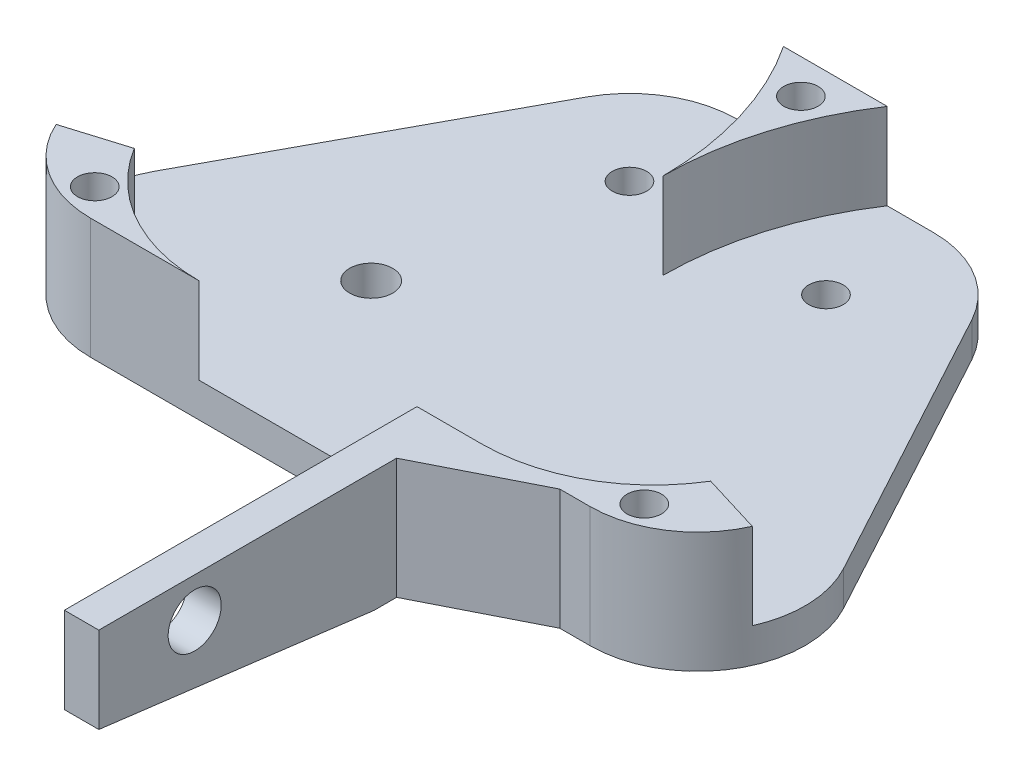
ISO-10303-21;
HEADER;
FILE_DESCRIPTION(('STEP AP214'),'2;1');
FILE_NAME('part.step','',(''),(''),'','','');
FILE_SCHEMA(('AUTOMOTIVE_DESIGN { 1 0 10303 214 1 1 1 1 }'));
ENDSEC;
DATA;
#1=APPLICATION_CONTEXT('core data for automotive mechanical design processes');
#2=APPLICATION_PROTOCOL_DEFINITION('international standard','automotive_design',2000,#1);
#3=PRODUCT_CONTEXT('',#1,'mechanical');
#4=PRODUCT('Part','Part','',(#3));
#5=PRODUCT_RELATED_PRODUCT_CATEGORY('part','',(#4));
#6=PRODUCT_DEFINITION_FORMATION('','',#4);
#7=PRODUCT_DEFINITION_CONTEXT('part definition',#1,'design');
#8=PRODUCT_DEFINITION('design','',#6,#7);
#9=PRODUCT_DEFINITION_SHAPE('','',#8);
#10=(LENGTH_UNIT() NAMED_UNIT(*) SI_UNIT(.MILLI.,.METRE.));
#11=(NAMED_UNIT(*) PLANE_ANGLE_UNIT() SI_UNIT($,.RADIAN.));
#12=(NAMED_UNIT(*) SI_UNIT($,.STERADIAN.) SOLID_ANGLE_UNIT());
#13=UNCERTAINTY_MEASURE_WITH_UNIT(LENGTH_MEASURE(1.E-05),#10,'distance_accuracy_value','');
#14=(GEOMETRIC_REPRESENTATION_CONTEXT(3) GLOBAL_UNCERTAINTY_ASSIGNED_CONTEXT((#13)) GLOBAL_UNIT_ASSIGNED_CONTEXT((#10,
#11,#12)) REPRESENTATION_CONTEXT('',''));
#15=CARTESIAN_POINT('',(0.,0.,0.));
#16=DIRECTION('',(0.,0.,1.));
#17=DIRECTION('',(1.,0.,0.));
#18=AXIS2_PLACEMENT_3D('',#15,#16,#17);
#19=CARTESIAN_POINT('',(0.,4.,20.));
#20=DIRECTION('',(0.,0.,-1.));
#21=DIRECTION('',(-1.,0.,0.));
#22=AXIS2_PLACEMENT_3D('',#19,#20,#21);
#23=PLANE('',#22);
#24=DIRECTION('',(-1.,0.,0.));
#25=VECTOR('',#24,1.);
#26=CARTESIAN_POINT('',(0.,14.,20.));
#27=LINE('',#26,#25);
#28=CARTESIAN_POINT('',(28.9958510837239,14.,20.));
#29=VERTEX_POINT('',#28);
#30=CARTESIAN_POINT('',(25.5011401283353,14.,20.));
#31=VERTEX_POINT('',#30);
#32=EDGE_CURVE('E110',#29,#31,#27,.T.);
#33=ORIENTED_EDGE('',*,*,#32,.T.);
#34=DIRECTION('',(0.,1.,0.));
#35=VECTOR('',#34,1.);
#36=CARTESIAN_POINT('',(25.5011401283353,-14.1051213627807,20.));
#37=LINE('',#36,#35);
#38=CARTESIAN_POINT('',(25.5011401283353,0.,20.));
#39=VERTEX_POINT('',#38);
#40=EDGE_CURVE('E105',#39,#31,#37,.T.);
#41=ORIENTED_EDGE('',*,*,#40,.F.);
#42=DIRECTION('',(1.,0.,0.));
#43=VECTOR('',#42,1.);
#44=CARTESIAN_POINT('',(0.,0.,20.));
#45=LINE('',#44,#43);
#46=CARTESIAN_POINT('',(28.9958510837239,0.,20.));
#47=VERTEX_POINT('',#46);
#48=EDGE_CURVE('E478',#39,#47,#45,.T.);
#49=ORIENTED_EDGE('',*,*,#48,.T.);
#50=DIRECTION('',(0.,-1.,0.));
#51=VECTOR('',#50,1.);
#52=CARTESIAN_POINT('',(28.9958510837239,4.,20.));
#53=LINE('',#52,#51);
#54=EDGE_CURVE('E98',#29,#47,#53,.T.);
#55=ORIENTED_EDGE('',*,*,#54,.F.);
#56=EDGE_LOOP('',(#33,#41,#49,#55));
#57=FACE_BOUND('',#56,.T.);
#58=ADVANCED_FACE('F89',(#57),#23,.F.);
#59=CARTESIAN_POINT('',(0.,4.,0.));
#60=DIRECTION('',(0.,1.,0.));
#61=DIRECTION('',(0.,0.,1.));
#62=AXIS2_PLACEMENT_3D('',#59,#60,#61);
#63=PLANE('',#62);
#64=CARTESIAN_POINT('',(-36.2069811131505,4.,-17.5));
#65=DIRECTION('',(0.,1.,0.));
#66=DIRECTION('',(0.,0.,1.));
#67=AXIS2_PLACEMENT_3D('',#64,#65,#66);
#68=CIRCLE('',#67,36.2069811131505);
#69=CARTESIAN_POINT('',(0.,4.,-17.5));
#70=VERTEX_POINT('',#69);
#71=CARTESIAN_POINT('',(-6.02510772318286,4.,-37.5));
#72=VERTEX_POINT('',#71);
#73=EDGE_CURVE('E329',#70,#72,#68,.T.);
#74=ORIENTED_EDGE('',*,*,#73,.T.);
#75=DIRECTION('',(1.,0.,0.));
#76=VECTOR('',#75,1.);
#77=CARTESIAN_POINT('',(0.,4.,-37.5));
#78=LINE('',#77,#76);
#79=CARTESIAN_POINT('',(-11.41,4.,-37.5));
#80=VERTEX_POINT('',#79);
#81=EDGE_CURVE('E452',#80,#72,#78,.T.);
#82=ORIENTED_EDGE('',*,*,#81,.F.);
#83=CARTESIAN_POINT('',(-11.41,4.,-25.));
#84=DIRECTION('',(0.,1.,0.));
#85=DIRECTION('',(0.,0.,1.));
#86=AXIS2_PLACEMENT_3D('',#83,#84,#85);
#87=CIRCLE('',#86,12.5);
#88=CARTESIAN_POINT('',(-22.4037432028954,4.,-30.9487486405791));
#89=VERTEX_POINT('',#88);
#90=EDGE_CURVE('E456',#80,#89,#87,.T.);
#91=ORIENTED_EDGE('',*,*,#90,.T.);
#92=DIRECTION('',(-0.475899891246327,0.,0.879499456231631));
#93=VECTOR('',#92,1.);
#94=CARTESIAN_POINT('',(-30.2834407311602,4.,-16.3864639692604));
#95=LINE('',#94,#93);
#96=CARTESIAN_POINT('',(-39.9895942866193,4.,1.55125135942092));
#97=VERTEX_POINT('',#96);
#98=EDGE_CURVE('E459',#89,#97,#95,.T.);
#99=ORIENTED_EDGE('',*,*,#98,.T.);
#100=CARTESIAN_POINT('',(-28.9958510837239,4.,7.5));
#101=DIRECTION('',(0.,1.,0.));
#102=DIRECTION('',(0.,0.,1.));
#103=AXIS2_PLACEMENT_3D('',#100,#101,#102);
#104=CIRCLE('',#103,12.5);
#105=CARTESIAN_POINT('',(-40.42167743443,4.,12.5695652874294));
#106=VERTEX_POINT('',#105);
#107=EDGE_CURVE('E430',#97,#106,#104,.T.);
#108=ORIENTED_EDGE('',*,*,#107,.T.);
#109=DIRECTION('',(0.956304755963037,0.,-0.292371704722731));
#110=VECTOR('',#109,1.);
#111=CARTESIAN_POINT('',(0.0591118064278248,4.,0.193346006837782));
#112=LINE('',#111,#110);
#113=CARTESIAN_POINT('',(-33.4669034451053,4.,10.4432774962822));
#114=VERTEX_POINT('',#113);
#115=EDGE_CURVE('E402',#106,#114,#112,.T.);
#116=ORIENTED_EDGE('',*,*,#115,.T.);
#117=CARTESIAN_POINT('',(-16.41,4.,0.));
#118=DIRECTION('',(0.,1.,0.));
#119=DIRECTION('',(0.,0.,1.));
#120=AXIS2_PLACEMENT_3D('',#117,#118,#119);
#121=CIRCLE('',#120,20.);
#122=CARTESIAN_POINT('',(-16.41,4.,20.));
#123=VERTEX_POINT('',#122);
#124=EDGE_CURVE('E396',#114,#123,#121,.T.);
#125=ORIENTED_EDGE('',*,*,#124,.T.);
#126=DIRECTION('',(1.,0.,0.));
#127=VECTOR('',#126,1.);
#128=CARTESIAN_POINT('',(0.,4.,20.));
#129=LINE('',#128,#127);
#130=CARTESIAN_POINT('',(8.9154,4.,20.));
#131=VERTEX_POINT('',#130);
#132=EDGE_CURVE('E436',#123,#131,#129,.T.);
#133=ORIENTED_EDGE('',*,*,#132,.T.);
#134=CARTESIAN_POINT('',(16.41,4.,20.));
#135=VERTEX_POINT('',#134);
#136=EDGE_CURVE('E434',#131,#135,#129,.T.);
#137=ORIENTED_EDGE('',*,*,#136,.T.);
#138=CARTESIAN_POINT('',(16.41,4.,0.));
#139=DIRECTION('',(0.,1.,0.));
#140=DIRECTION('',(0.,0.,1.));
#141=AXIS2_PLACEMENT_3D('',#138,#139,#140);
#142=CIRCLE('',#141,20.);
#143=CARTESIAN_POINT('',(33.4669034451053,4.,10.4432774962822));
#144=VERTEX_POINT('',#143);
#145=EDGE_CURVE('E367',#135,#144,#142,.T.);
#146=ORIENTED_EDGE('',*,*,#145,.T.);
#147=DIRECTION('',(-0.956304755963037,0.,-0.29237170472273));
#148=VECTOR('',#147,1.);
#149=CARTESIAN_POINT('',(-0.0591118064278277,4.,0.193346006837792));
#150=LINE('',#149,#148);
#151=CARTESIAN_POINT('',(40.42167743443,4.,12.5695652874294));
#152=VERTEX_POINT('',#151);
#153=EDGE_CURVE('E362',#152,#144,#150,.T.);
#154=ORIENTED_EDGE('',*,*,#153,.F.);
#155=CARTESIAN_POINT('',(28.9958510837239,4.,7.5));
#156=DIRECTION('',(0.,1.,0.));
#157=DIRECTION('',(0.,0.,1.));
#158=AXIS2_PLACEMENT_3D('',#155,#156,#157);
#159=CIRCLE('',#158,12.5);
#160=CARTESIAN_POINT('',(39.9895942866193,4.,1.55125135942092));
#161=VERTEX_POINT('',#160);
#162=EDGE_CURVE('E440',#161,#152,#159,.F.);
#163=ORIENTED_EDGE('',*,*,#162,.F.);
#164=DIRECTION('',(-0.475899891246326,0.,-0.879499456231631));
#165=VECTOR('',#164,1.);
#166=CARTESIAN_POINT('',(30.2834407311602,4.,-16.3864639692604));
#167=LINE('',#166,#165);
#168=CARTESIAN_POINT('',(22.4037432028954,4.,-30.9487486405791));
#169=VERTEX_POINT('',#168);
#170=EDGE_CURVE('E444',#161,#169,#167,.T.);
#171=ORIENTED_EDGE('',*,*,#170,.T.);
#172=CARTESIAN_POINT('',(11.41,4.,-25.));
#173=DIRECTION('',(0.,1.,0.));
#174=DIRECTION('',(0.,0.,1.));
#175=AXIS2_PLACEMENT_3D('',#172,#173,#174);
#176=CIRCLE('',#175,12.5);
#177=CARTESIAN_POINT('',(11.41,4.,-37.5));
#178=VERTEX_POINT('',#177);
#179=EDGE_CURVE('E447',#169,#178,#176,.T.);
#180=ORIENTED_EDGE('',*,*,#179,.T.);
#181=CARTESIAN_POINT('',(6.02510772318288,4.,-37.5));
#182=VERTEX_POINT('',#181);
#183=EDGE_CURVE('E451',#182,#178,#78,.T.);
#184=ORIENTED_EDGE('',*,*,#183,.F.);
#185=CARTESIAN_POINT('',(36.2069811131505,4.,-17.5));
#186=DIRECTION('',(0.,1.,0.));
#187=DIRECTION('',(0.,0.,1.));
#188=AXIS2_PLACEMENT_3D('',#185,#186,#187);
#189=CIRCLE('',#188,36.2069811131505);
#190=EDGE_CURVE('E334',#182,#70,#189,.T.);
#191=ORIENTED_EDGE('',*,*,#190,.T.);
#192=EDGE_LOOP('',(#74,#82,#91,#99,#108,#116,#125,#133,#137,#146,#154,#163,#171,#180,#184,#191));
#193=FACE_BOUND('',#192,.T.);
#194=CARTESIAN_POINT('',(-16.41,4.,0.));
#195=DIRECTION('',(0.,1.,0.));
#196=DIRECTION('',(0.,0.,1.));
#197=AXIS2_PLACEMENT_3D('',#194,#195,#196);
#198=CIRCLE('',#197,2.5);
#199=CARTESIAN_POINT('',(-16.41,4.,2.5));
#200=VERTEX_POINT('',#199);
#201=EDGE_CURVE('E462',#200,#200,#198,.T.);
#202=ORIENTED_EDGE('',*,*,#201,.F.);
#203=EDGE_LOOP('',(#202));
#204=FACE_BOUND('',#203,.T.);
#205=CARTESIAN_POINT('',(-11.41,4.,-25.));
#206=DIRECTION('',(0.,1.,0.));
#207=DIRECTION('',(0.,0.,1.));
#208=AXIS2_PLACEMENT_3D('',#205,#206,#207);
#209=CIRCLE('',#208,2.);
#210=CARTESIAN_POINT('',(-11.41,4.,-23.));
#211=VERTEX_POINT('',#210);
#212=EDGE_CURVE('E466',#211,#211,#209,.T.);
#213=ORIENTED_EDGE('',*,*,#212,.F.);
#214=EDGE_LOOP('',(#213));
#215=FACE_BOUND('',#214,.T.);
#216=CARTESIAN_POINT('',(11.41,4.,-25.));
#217=DIRECTION('',(0.,1.,0.));
#218=DIRECTION('',(0.,0.,1.));
#219=AXIS2_PLACEMENT_3D('',#216,#217,#218);
#220=CIRCLE('',#219,2.);
#221=CARTESIAN_POINT('',(11.41,4.,-23.));
#222=VERTEX_POINT('',#221);
#223=EDGE_CURVE('E470',#222,#222,#220,.T.);
#224=ORIENTED_EDGE('',*,*,#223,.F.);
#225=EDGE_LOOP('',(#224));
#226=FACE_BOUND('',#225,.T.);
#227=ADVANCED_FACE('F567',(#193,#204,#215,#226),#63,.T.);
#228=CARTESIAN_POINT('',(-28.9958510837239,4.,7.5));
#229=DIRECTION('',(0.,-1.,0.));
#230=DIRECTION('',(0.,0.,-1.));
#231=AXIS2_PLACEMENT_3D('',#228,#229,#230);
#232=CYLINDRICAL_SURFACE('',#231,12.5);
#233=CARTESIAN_POINT('',(-28.9958510837239,0.,7.5));
#234=DIRECTION('',(0.,1.,0.));
#235=DIRECTION('',(0.,0.,1.));
#236=AXIS2_PLACEMENT_3D('',#233,#234,#235);
#237=CIRCLE('',#236,12.5);
#238=CARTESIAN_POINT('',(-39.9895942866193,0.,1.55125135942092));
#239=VERTEX_POINT('',#238);
#240=CARTESIAN_POINT('',(-28.9958510837239,0.,20.));
#241=VERTEX_POINT('',#240);
#242=EDGE_CURVE('E429',#239,#241,#237,.T.);
#243=ORIENTED_EDGE('',*,*,#242,.T.);
#244=DIRECTION('',(0.,-1.,0.));
#245=VECTOR('',#244,1.);
#246=CARTESIAN_POINT('',(-28.9958510837239,4.,20.));
#247=LINE('',#246,#245);
#248=CARTESIAN_POINT('',(-28.9958510837239,14.,20.));
#249=VERTEX_POINT('',#248);
#250=EDGE_CURVE('E12',#249,#241,#247,.T.);
#251=ORIENTED_EDGE('',*,*,#250,.F.);
#252=CARTESIAN_POINT('',(-28.9958510837239,14.,7.5));
#253=DIRECTION('',(0.,1.,0.));
#254=DIRECTION('',(0.,0.,1.));
#255=AXIS2_PLACEMENT_3D('',#252,#253,#254);
#256=CIRCLE('',#255,12.5);
#257=CARTESIAN_POINT('',(-40.42167743443,14.,12.5695652874294));
#258=VERTEX_POINT('',#257);
#259=EDGE_CURVE('E397',#258,#249,#256,.T.);
#260=ORIENTED_EDGE('',*,*,#259,.F.);
#261=DIRECTION('',(0.,-1.,0.));
#262=VECTOR('',#261,1.);
#263=CARTESIAN_POINT('',(-40.42167743443,14.,12.5695652874294));
#264=LINE('',#263,#262);
#265=EDGE_CURVE('E414',#258,#106,#264,.T.);
#266=ORIENTED_EDGE('',*,*,#265,.T.);
#267=ORIENTED_EDGE('',*,*,#107,.F.);
#268=DIRECTION('',(0.,-1.,0.));
#269=VECTOR('',#268,1.);
#270=CARTESIAN_POINT('',(-39.9895942866193,4.,1.55125135942092));
#271=LINE('',#270,#269);
#272=EDGE_CURVE('E474',#97,#239,#271,.T.);
#273=ORIENTED_EDGE('',*,*,#272,.T.);
#274=EDGE_LOOP('',(#243,#251,#260,#266,#267,#273));
#275=FACE_BOUND('',#274,.T.);
#276=ADVANCED_FACE('F91',(#275),#232,.T.);
#277=CARTESIAN_POINT('',(8.9154,0.,20.));
#278=VERTEX_POINT('',#277);
#279=EDGE_CURVE('E479',#241,#278,#45,.T.);
#280=ORIENTED_EDGE('',*,*,#279,.T.);
#281=DIRECTION('',(0.,1.,0.));
#282=VECTOR('',#281,1.);
#283=CARTESIAN_POINT('',(8.9154,14.,20.));
#284=LINE('',#283,#282);
#285=EDGE_CURVE('E296',#278,#131,#284,.T.);
#286=ORIENTED_EDGE('',*,*,#285,.T.);
#287=ORIENTED_EDGE('',*,*,#132,.F.);
#288=DIRECTION('',(0.,-1.,0.));
#289=VECTOR('',#288,1.);
#290=CARTESIAN_POINT('',(-16.41,14.,20.));
#291=LINE('',#290,#289);
#292=CARTESIAN_POINT('',(-16.41,14.,20.));
#293=VERTEX_POINT('',#292);
#294=EDGE_CURVE('E426',#293,#123,#291,.T.);
#295=ORIENTED_EDGE('',*,*,#294,.F.);
#296=DIRECTION('',(-1.,0.,0.));
#297=VECTOR('',#296,1.);
#298=CARTESIAN_POINT('',(0.,14.,20.));
#299=LINE('',#298,#297);
#300=EDGE_CURVE('E401',#293,#249,#299,.T.);
#301=ORIENTED_EDGE('',*,*,#300,.T.);
#302=ORIENTED_EDGE('',*,*,#250,.T.);
#303=EDGE_LOOP('',(#280,#286,#287,#295,#301,#302));
#304=FACE_BOUND('',#303,.T.);
#305=ADVANCED_FACE('F636',(#304),#23,.F.);
#306=CARTESIAN_POINT('',(28.9958510837239,4.,7.5));
#307=DIRECTION('',(0.,-1.,0.));
#308=DIRECTION('',(0.,0.,-1.));
#309=AXIS2_PLACEMENT_3D('',#306,#307,#308);
#310=CYLINDRICAL_SURFACE('',#309,12.5);
#311=CARTESIAN_POINT('',(28.9958510837239,0.,7.5));
#312=DIRECTION('',(0.,1.,0.));
#313=DIRECTION('',(0.,0.,1.));
#314=AXIS2_PLACEMENT_3D('',#311,#312,#313);
#315=CIRCLE('',#314,12.5);
#316=CARTESIAN_POINT('',(39.9895942866193,0.,1.55125135942092));
#317=VERTEX_POINT('',#316);
#318=EDGE_CURVE('E482',#317,#47,#315,.F.);
#319=ORIENTED_EDGE('',*,*,#318,.F.);
#320=DIRECTION('',(0.,-1.,0.));
#321=VECTOR('',#320,1.);
#322=CARTESIAN_POINT('',(39.9895942866193,4.,1.55125135942092));
#323=LINE('',#322,#321);
#324=EDGE_CURVE('E543',#161,#317,#323,.T.);
#325=ORIENTED_EDGE('',*,*,#324,.F.);
#326=ORIENTED_EDGE('',*,*,#162,.T.);
#327=DIRECTION('',(0.,-1.,0.));
#328=VECTOR('',#327,1.);
#329=CARTESIAN_POINT('',(40.42167743443,14.,12.5695652874294));
#330=LINE('',#329,#328);
#331=CARTESIAN_POINT('',(40.42167743443,14.,12.5695652874294));
#332=VERTEX_POINT('',#331);
#333=EDGE_CURVE('E376',#332,#152,#330,.T.);
#334=ORIENTED_EDGE('',*,*,#333,.F.);
#335=CARTESIAN_POINT('',(28.9958510837239,14.,7.5));
#336=DIRECTION('',(0.,1.,0.));
#337=DIRECTION('',(0.,0.,1.));
#338=AXIS2_PLACEMENT_3D('',#335,#336,#337);
#339=CIRCLE('',#338,12.5);
#340=EDGE_CURVE('E373',#29,#332,#339,.T.);
#341=ORIENTED_EDGE('',*,*,#340,.F.);
#342=ORIENTED_EDGE('',*,*,#54,.T.);
#343=EDGE_LOOP('',(#319,#325,#326,#334,#341,#342));
#344=FACE_BOUND('',#343,.T.);
#345=ADVANCED_FACE('F550',(#344),#310,.T.);
#346=CARTESIAN_POINT('',(30.2834407311602,4.,-16.3864639692604));
#347=DIRECTION('',(-0.879499456231631,0.,0.475899891246326));
#348=DIRECTION('',(0.475899891246326,0.,0.879499456231631));
#349=AXIS2_PLACEMENT_3D('',#346,#347,#348);
#350=PLANE('',#349);
#351=DIRECTION('',(-0.475899891246326,0.,-0.879499456231631));
#352=VECTOR('',#351,1.);
#353=CARTESIAN_POINT('',(30.2834407311602,0.,-16.3864639692604));
#354=LINE('',#353,#352);
#355=CARTESIAN_POINT('',(22.4037432028954,0.,-30.9487486405791));
#356=VERTEX_POINT('',#355);
#357=EDGE_CURVE('E486',#317,#356,#354,.T.);
#358=ORIENTED_EDGE('',*,*,#357,.T.);
#359=DIRECTION('',(0.,-1.,0.));
#360=VECTOR('',#359,1.);
#361=CARTESIAN_POINT('',(22.4037432028954,4.,-30.9487486405791));
#362=LINE('',#361,#360);
#363=EDGE_CURVE('E539',#169,#356,#362,.T.);
#364=ORIENTED_EDGE('',*,*,#363,.F.);
#365=ORIENTED_EDGE('',*,*,#170,.F.);
#366=ORIENTED_EDGE('',*,*,#324,.T.);
#367=EDGE_LOOP('',(#358,#364,#365,#366));
#368=FACE_BOUND('',#367,.T.);
#369=ADVANCED_FACE('F559',(#368),#350,.F.);
#370=CARTESIAN_POINT('',(11.41,4.,-25.));
#371=DIRECTION('',(0.,-1.,0.));
#372=DIRECTION('',(0.,0.,-1.));
#373=AXIS2_PLACEMENT_3D('',#370,#371,#372);
#374=CYLINDRICAL_SURFACE('',#373,12.5);
#375=CARTESIAN_POINT('',(11.41,0.,-25.));
#376=DIRECTION('',(0.,1.,0.));
#377=DIRECTION('',(0.,0.,1.));
#378=AXIS2_PLACEMENT_3D('',#375,#376,#377);
#379=CIRCLE('',#378,12.5);
#380=CARTESIAN_POINT('',(11.41,0.,-37.5));
#381=VERTEX_POINT('',#380);
#382=EDGE_CURVE('E489',#356,#381,#379,.T.);
#383=ORIENTED_EDGE('',*,*,#382,.T.);
#384=DIRECTION('',(0.,-1.,0.));
#385=VECTOR('',#384,1.);
#386=CARTESIAN_POINT('',(11.41,4.,-37.5));
#387=LINE('',#386,#385);
#388=EDGE_CURVE('E536',#178,#381,#387,.T.);
#389=ORIENTED_EDGE('',*,*,#388,.F.);
#390=ORIENTED_EDGE('',*,*,#179,.F.);
#391=ORIENTED_EDGE('',*,*,#363,.T.);
#392=EDGE_LOOP('',(#383,#389,#390,#391));
#393=FACE_BOUND('',#392,.T.);
#394=ADVANCED_FACE('F563',(#393),#374,.T.);
#395=CARTESIAN_POINT('',(0.,4.,-37.5));
#396=DIRECTION('',(0.,0.,-1.));
#397=DIRECTION('',(-1.,0.,0.));
#398=AXIS2_PLACEMENT_3D('',#395,#396,#397);
#399=PLANE('',#398);
#400=DIRECTION('',(1.,0.,0.));
#401=VECTOR('',#400,1.);
#402=CARTESIAN_POINT('',(0.,0.,-37.5));
#403=LINE('',#402,#401);
#404=CARTESIAN_POINT('',(-11.41,0.,-37.5));
#405=VERTEX_POINT('',#404);
#406=EDGE_CURVE('E493',#405,#381,#403,.T.);
#407=ORIENTED_EDGE('',*,*,#406,.F.);
#408=DIRECTION('',(0.,-1.,0.));
#409=VECTOR('',#408,1.);
#410=CARTESIAN_POINT('',(-11.41,4.,-37.5));
#411=LINE('',#410,#409);
#412=EDGE_CURVE('E533',#80,#405,#411,.T.);
#413=ORIENTED_EDGE('',*,*,#412,.F.);
#414=ORIENTED_EDGE('',*,*,#81,.T.);
#415=DIRECTION('',(0.,-1.,0.));
#416=VECTOR('',#415,1.);
#417=CARTESIAN_POINT('',(-6.02510772318286,14.,-37.5));
#418=LINE('',#417,#416);
#419=CARTESIAN_POINT('',(-6.02510772318286,14.,-37.5));
#420=VERTEX_POINT('',#419);
#421=EDGE_CURVE('E355',#420,#72,#418,.T.);
#422=ORIENTED_EDGE('',*,*,#421,.F.);
#423=DIRECTION('',(-1.,0.,0.));
#424=VECTOR('',#423,1.);
#425=CARTESIAN_POINT('',(0.,14.,-37.5));
#426=LINE('',#425,#424);
#427=CARTESIAN_POINT('',(6.02510772318288,14.,-37.5));
#428=VERTEX_POINT('',#427);
#429=EDGE_CURVE('E330',#428,#420,#426,.T.);
#430=ORIENTED_EDGE('',*,*,#429,.F.);
#431=DIRECTION('',(0.,-1.,0.));
#432=VECTOR('',#431,1.);
#433=CARTESIAN_POINT('',(6.02510772318288,14.,-37.5));
#434=LINE('',#433,#432);
#435=EDGE_CURVE('E342',#428,#182,#434,.T.);
#436=ORIENTED_EDGE('',*,*,#435,.T.);
#437=ORIENTED_EDGE('',*,*,#183,.T.);
#438=ORIENTED_EDGE('',*,*,#388,.T.);
#439=EDGE_LOOP('',(#407,#413,#414,#422,#430,#436,#437,#438));
#440=FACE_BOUND('',#439,.T.);
#441=ADVANCED_FACE('F605',(#440),#399,.T.);
#442=CARTESIAN_POINT('',(-11.41,4.,-25.));
#443=DIRECTION('',(0.,-1.,0.));
#444=DIRECTION('',(0.,0.,-1.));
#445=AXIS2_PLACEMENT_3D('',#442,#443,#444);
#446=CYLINDRICAL_SURFACE('',#445,12.5);
#447=CARTESIAN_POINT('',(-11.41,0.,-25.));
#448=DIRECTION('',(0.,1.,0.));
#449=DIRECTION('',(0.,0.,1.));
#450=AXIS2_PLACEMENT_3D('',#447,#448,#449);
#451=CIRCLE('',#450,12.5);
#452=CARTESIAN_POINT('',(-22.4037432028954,0.,-30.9487486405791));
#453=VERTEX_POINT('',#452);
#454=EDGE_CURVE('E497',#405,#453,#451,.T.);
#455=ORIENTED_EDGE('',*,*,#454,.T.);
#456=DIRECTION('',(0.,-1.,0.));
#457=VECTOR('',#456,1.);
#458=CARTESIAN_POINT('',(-22.4037432028954,4.,-30.9487486405791));
#459=LINE('',#458,#457);
#460=EDGE_CURVE('E529',#89,#453,#459,.T.);
#461=ORIENTED_EDGE('',*,*,#460,.F.);
#462=ORIENTED_EDGE('',*,*,#90,.F.);
#463=ORIENTED_EDGE('',*,*,#412,.T.);
#464=EDGE_LOOP('',(#455,#461,#462,#463));
#465=FACE_BOUND('',#464,.T.);
#466=ADVANCED_FACE('F618',(#465),#446,.T.);
#467=CARTESIAN_POINT('',(-31.91,4.,16.6));
#468=DIRECTION('',(0.,-1.,0.));
#469=DIRECTION('',(0.,0.,-1.));
#470=AXIS2_PLACEMENT_3D('',#467,#468,#469);
#471=CYLINDRICAL_SURFACE('',#470,2.);
#472=CARTESIAN_POINT('',(-31.91,0.,16.6));
#473=DIRECTION('',(0.,1.,0.));
#474=DIRECTION('',(0.,0.,1.));
#475=AXIS2_PLACEMENT_3D('',#472,#473,#474);
#476=CIRCLE('',#475,2.);
#477=CARTESIAN_POINT('',(-31.91,0.,18.6));
#478=VERTEX_POINT('',#477);
#479=EDGE_CURVE('E519',#478,#478,#476,.F.);
#480=ORIENTED_EDGE('',*,*,#479,.T.);
#481=EDGE_LOOP('',(#480));
#482=FACE_BOUND('',#481,.T.);
#483=CARTESIAN_POINT('',(-31.91,14.,16.6));
#484=DIRECTION('',(0.,1.,0.));
#485=DIRECTION('',(0.,0.,1.));
#486=AXIS2_PLACEMENT_3D('',#483,#484,#485);
#487=CIRCLE('',#486,2.);
#488=CARTESIAN_POINT('',(-31.91,14.,18.6));
#489=VERTEX_POINT('',#488);
#490=EDGE_CURVE('E392',#489,#489,#487,.T.);
#491=ORIENTED_EDGE('',*,*,#490,.T.);
#492=EDGE_LOOP('',(#491));
#493=FACE_BOUND('',#492,.T.);
#494=ADVANCED_FACE('F690',(#482,#493),#471,.F.);
#495=CARTESIAN_POINT('',(31.91,4.,16.6));
#496=DIRECTION('',(0.,-1.,0.));
#497=DIRECTION('',(0.,0.,-1.));
#498=AXIS2_PLACEMENT_3D('',#495,#496,#497);
#499=CYLINDRICAL_SURFACE('',#498,2.);
#500=CARTESIAN_POINT('',(31.91,0.,16.6));
#501=DIRECTION('',(0.,1.,0.));
#502=DIRECTION('',(0.,0.,1.));
#503=AXIS2_PLACEMENT_3D('',#500,#501,#502);
#504=CIRCLE('',#503,2.);
#505=CARTESIAN_POINT('',(31.91,0.,18.6));
#506=VERTEX_POINT('',#505);
#507=EDGE_CURVE('E515',#506,#506,#504,.T.);
#508=ORIENTED_EDGE('',*,*,#507,.F.);
#509=EDGE_LOOP('',(#508));
#510=FACE_BOUND('',#509,.T.);
#511=CARTESIAN_POINT('',(31.91,14.,16.6));
#512=DIRECTION('',(0.,1.,0.));
#513=DIRECTION('',(0.,0.,1.));
#514=AXIS2_PLACEMENT_3D('',#511,#512,#513);
#515=CIRCLE('',#514,2.);
#516=CARTESIAN_POINT('',(31.91,14.,18.6));
#517=VERTEX_POINT('',#516);
#518=EDGE_CURVE('E358',#517,#517,#515,.T.);
#519=ORIENTED_EDGE('',*,*,#518,.T.);
#520=EDGE_LOOP('',(#519));
#521=FACE_BOUND('',#520,.T.);
#522=ADVANCED_FACE('F693',(#510,#521),#499,.F.);
#523=CARTESIAN_POINT('',(11.41,4.,-25.));
#524=DIRECTION('',(0.,-1.,0.));
#525=DIRECTION('',(0.,0.,-1.));
#526=AXIS2_PLACEMENT_3D('',#523,#524,#525);
#527=CYLINDRICAL_SURFACE('',#526,2.);
#528=ORIENTED_EDGE('',*,*,#223,.T.);
#529=EDGE_LOOP('',(#528));
#530=FACE_BOUND('',#529,.T.);
#531=CARTESIAN_POINT('',(11.41,0.,-25.));
#532=DIRECTION('',(0.,1.,0.));
#533=DIRECTION('',(0.,0.,1.));
#534=AXIS2_PLACEMENT_3D('',#531,#532,#533);
#535=CIRCLE('',#534,2.);
#536=CARTESIAN_POINT('',(11.41,0.,-23.));
#537=VERTEX_POINT('',#536);
#538=EDGE_CURVE('E511',#537,#537,#535,.T.);
#539=ORIENTED_EDGE('',*,*,#538,.F.);
#540=EDGE_LOOP('',(#539));
#541=FACE_BOUND('',#540,.T.);
#542=ADVANCED_FACE('F702',(#530,#541),#527,.F.);
#543=CARTESIAN_POINT('',(-11.41,4.,-25.));
#544=DIRECTION('',(0.,-1.,0.));
#545=DIRECTION('',(0.,0.,-1.));
#546=AXIS2_PLACEMENT_3D('',#543,#544,#545);
#547=CYLINDRICAL_SURFACE('',#546,2.);
#548=ORIENTED_EDGE('',*,*,#212,.T.);
#549=EDGE_LOOP('',(#548));
#550=FACE_BOUND('',#549,.T.);
#551=CARTESIAN_POINT('',(-11.41,0.,-25.));
#552=DIRECTION('',(0.,1.,0.));
#553=DIRECTION('',(0.,0.,1.));
#554=AXIS2_PLACEMENT_3D('',#551,#552,#553);
#555=CIRCLE('',#554,2.);
#556=CARTESIAN_POINT('',(-11.41,0.,-23.));
#557=VERTEX_POINT('',#556);
#558=EDGE_CURVE('E507',#557,#557,#555,.T.);
#559=ORIENTED_EDGE('',*,*,#558,.F.);
#560=EDGE_LOOP('',(#559));
#561=FACE_BOUND('',#560,.T.);
#562=ADVANCED_FACE('F916',(#550,#561),#547,.F.);
#563=CARTESIAN_POINT('',(-16.41,4.,0.));
#564=DIRECTION('',(0.,-1.,0.));
#565=DIRECTION('',(0.,0.,-1.));
#566=AXIS2_PLACEMENT_3D('',#563,#564,#565);
#567=CYLINDRICAL_SURFACE('',#566,2.5);
#568=ORIENTED_EDGE('',*,*,#201,.T.);
#569=EDGE_LOOP('',(#568));
#570=FACE_BOUND('',#569,.T.);
#571=CARTESIAN_POINT('',(-16.41,0.,0.));
#572=DIRECTION('',(0.,1.,0.));
#573=DIRECTION('',(0.,0.,1.));
#574=AXIS2_PLACEMENT_3D('',#571,#572,#573);
#575=CIRCLE('',#574,2.5);
#576=CARTESIAN_POINT('',(-16.41,0.,2.5));
#577=VERTEX_POINT('',#576);
#578=EDGE_CURVE('E503',#577,#577,#575,.T.);
#579=ORIENTED_EDGE('',*,*,#578,.F.);
#580=EDGE_LOOP('',(#579));
#581=FACE_BOUND('',#580,.T.);
#582=ADVANCED_FACE('F909',(#570,#581),#567,.F.);
#583=CARTESIAN_POINT('',(-30.2834407311602,4.,-16.3864639692604));
#584=DIRECTION('',(0.879499456231631,0.,0.475899891246327));
#585=DIRECTION('',(0.475899891246327,0.,-0.879499456231631));
#586=AXIS2_PLACEMENT_3D('',#583,#584,#585);
#587=PLANE('',#586);
#588=DIRECTION('',(-0.475899891246327,0.,0.879499456231631));
#589=VECTOR('',#588,1.);
#590=CARTESIAN_POINT('',(-30.2834407311602,0.,-16.3864639692604));
#591=LINE('',#590,#589);
#592=EDGE_CURVE('E500',#453,#239,#591,.T.);
#593=ORIENTED_EDGE('',*,*,#592,.T.);
#594=ORIENTED_EDGE('',*,*,#272,.F.);
#595=ORIENTED_EDGE('',*,*,#98,.F.);
#596=ORIENTED_EDGE('',*,*,#460,.T.);
#597=EDGE_LOOP('',(#593,#594,#595,#596));
#598=FACE_BOUND('',#597,.T.);
#599=ADVANCED_FACE('F623',(#598),#587,.F.);
#600=CARTESIAN_POINT('',(0.,4.,-33.5));
#601=DIRECTION('',(0.,-1.,0.));
#602=DIRECTION('',(0.,0.,-1.));
#603=AXIS2_PLACEMENT_3D('',#600,#601,#602);
#604=CYLINDRICAL_SURFACE('',#603,2.);
#605=CARTESIAN_POINT('',(0.,0.,-33.5));
#606=DIRECTION('',(0.,1.,0.));
#607=DIRECTION('',(0.,0.,1.));
#608=AXIS2_PLACEMENT_3D('',#605,#606,#607);
#609=CIRCLE('',#608,2.);
#610=CARTESIAN_POINT('',(0.,0.,-31.5));
#611=VERTEX_POINT('',#610);
#612=EDGE_CURVE('E435',#611,#611,#609,.T.);
#613=ORIENTED_EDGE('',*,*,#612,.F.);
#614=EDGE_LOOP('',(#613));
#615=FACE_BOUND('',#614,.T.);
#616=CARTESIAN_POINT('',(0.,14.,-33.5));
#617=DIRECTION('',(0.,1.,0.));
#618=DIRECTION('',(0.,0.,1.));
#619=AXIS2_PLACEMENT_3D('',#616,#617,#618);
#620=CIRCLE('',#619,2.);
#621=CARTESIAN_POINT('',(0.,14.,-31.5));
#622=VERTEX_POINT('',#621);
#623=EDGE_CURVE('E325',#622,#622,#620,.T.);
#624=ORIENTED_EDGE('',*,*,#623,.T.);
#625=EDGE_LOOP('',(#624));
#626=FACE_BOUND('',#625,.T.);
#627=ADVANCED_FACE('F709',(#615,#626),#604,.F.);
#628=CARTESIAN_POINT('',(0.,0.,0.));
#629=DIRECTION('',(0.,1.,0.));
#630=DIRECTION('',(0.,0.,1.));
#631=AXIS2_PLACEMENT_3D('',#628,#629,#630);
#632=PLANE('',#631);
#633=ORIENTED_EDGE('',*,*,#48,.F.);
#634=DIRECTION('',(-0.892281590823126,0.,0.451479304817122));
#635=VECTOR('',#634,1.);
#636=CARTESIAN_POINT('',(13.2549216912322,0.,26.1963781876543));
#637=LINE('',#636,#635);
#638=CARTESIAN_POINT('',(12.9154,0.,26.3681703872294));
#639=VERTEX_POINT('',#638);
#640=EDGE_CURVE('E270',#39,#639,#637,.T.);
#641=ORIENTED_EDGE('',*,*,#640,.T.);
#642=DIRECTION('',(0.,0.,-1.));
#643=VECTOR('',#642,1.);
#644=CARTESIAN_POINT('',(12.9154,0.,20.));
#645=LINE('',#644,#643);
#646=CARTESIAN_POINT('',(12.9154,0.,28.9933394303566));
#647=VERTEX_POINT('',#646);
#648=EDGE_CURVE('E265',#647,#639,#645,.T.);
#649=ORIENTED_EDGE('',*,*,#648,.F.);
#650=DIRECTION('',(-1.,0.,0.));
#651=VECTOR('',#650,1.);
#652=CARTESIAN_POINT('',(12.9154,0.,28.9933394303566));
#653=LINE('',#652,#651);
#654=CARTESIAN_POINT('',(8.9154,0.,28.9933394303566));
#655=VERTEX_POINT('',#654);
#656=EDGE_CURVE('E295',#647,#655,#653,.T.);
#657=ORIENTED_EDGE('',*,*,#656,.T.);
#658=DIRECTION('',(0.,0.,-1.));
#659=VECTOR('',#658,1.);
#660=CARTESIAN_POINT('',(8.9154,0.,20.));
#661=LINE('',#660,#659);
#662=EDGE_CURVE('E258',#655,#278,#661,.T.);
#663=ORIENTED_EDGE('',*,*,#662,.T.);
#664=ORIENTED_EDGE('',*,*,#279,.F.);
#665=ORIENTED_EDGE('',*,*,#242,.F.);
#666=ORIENTED_EDGE('',*,*,#592,.F.);
#667=ORIENTED_EDGE('',*,*,#454,.F.);
#668=ORIENTED_EDGE('',*,*,#406,.T.);
#669=ORIENTED_EDGE('',*,*,#382,.F.);
#670=ORIENTED_EDGE('',*,*,#357,.F.);
#671=ORIENTED_EDGE('',*,*,#318,.T.);
#672=EDGE_LOOP('',(#633,#641,#649,#657,#663,#664,#665,#666,#667,#668,#669,#670,#671));
#673=FACE_BOUND('',#672,.T.);
#674=ORIENTED_EDGE('',*,*,#578,.T.);
#675=EDGE_LOOP('',(#674));
#676=FACE_BOUND('',#675,.T.);
#677=ORIENTED_EDGE('',*,*,#558,.T.);
#678=EDGE_LOOP('',(#677));
#679=FACE_BOUND('',#678,.T.);
#680=ORIENTED_EDGE('',*,*,#538,.T.);
#681=EDGE_LOOP('',(#680));
#682=FACE_BOUND('',#681,.T.);
#683=ORIENTED_EDGE('',*,*,#507,.T.);
#684=EDGE_LOOP('',(#683));
#685=FACE_BOUND('',#684,.T.);
#686=ORIENTED_EDGE('',*,*,#479,.F.);
#687=EDGE_LOOP('',(#686));
#688=FACE_BOUND('',#687,.T.);
#689=ORIENTED_EDGE('',*,*,#612,.T.);
#690=EDGE_LOOP('',(#689));
#691=FACE_BOUND('',#690,.T.);
#692=ADVANCED_FACE('F554',(#673,#676,#679,#682,#685,#688,#691),#632,.F.);
#693=CARTESIAN_POINT('',(-28.9958510837239,14.,7.5));
#694=DIRECTION('',(0.,1.,0.));
#695=DIRECTION('',(0.,0.,1.));
#696=AXIS2_PLACEMENT_3D('',#693,#694,#695);
#697=PLANE('',#696);
#698=ORIENTED_EDGE('',*,*,#259,.T.);
#699=ORIENTED_EDGE('',*,*,#300,.F.);
#700=CARTESIAN_POINT('',(-16.41,14.,0.));
#701=DIRECTION('',(0.,1.,0.));
#702=DIRECTION('',(0.,0.,1.));
#703=AXIS2_PLACEMENT_3D('',#700,#701,#702);
#704=CIRCLE('',#703,20.);
#705=CARTESIAN_POINT('',(-33.4669034451053,14.,10.4432774962822));
#706=VERTEX_POINT('',#705);
#707=EDGE_CURVE('E406',#706,#293,#704,.T.);
#708=ORIENTED_EDGE('',*,*,#707,.F.);
#709=DIRECTION('',(0.956304755963037,0.,-0.292371704722731));
#710=VECTOR('',#709,1.);
#711=CARTESIAN_POINT('',(0.0591118064278248,14.,0.193346006837782));
#712=LINE('',#711,#710);
#713=EDGE_CURVE('E410',#258,#706,#712,.T.);
#714=ORIENTED_EDGE('',*,*,#713,.F.);
#715=EDGE_LOOP('',(#698,#699,#708,#714));
#716=FACE_BOUND('',#715,.T.);
#717=ORIENTED_EDGE('',*,*,#490,.F.);
#718=EDGE_LOOP('',(#717));
#719=FACE_BOUND('',#718,.T.);
#720=ADVANCED_FACE('F639',(#716,#719),#697,.T.);
#721=CARTESIAN_POINT('',(-16.41,14.,0.));
#722=DIRECTION('',(0.,-1.,0.));
#723=DIRECTION('',(0.,0.,-1.));
#724=AXIS2_PLACEMENT_3D('',#721,#722,#723);
#725=CYLINDRICAL_SURFACE('',#724,20.);
#726=ORIENTED_EDGE('',*,*,#124,.F.);
#727=DIRECTION('',(0.,-1.,0.));
#728=VECTOR('',#727,1.);
#729=CARTESIAN_POINT('',(-33.4669034451053,14.,10.4432774962822));
#730=LINE('',#729,#728);
#731=EDGE_CURVE('E423',#706,#114,#730,.T.);
#732=ORIENTED_EDGE('',*,*,#731,.F.);
#733=ORIENTED_EDGE('',*,*,#707,.T.);
#734=ORIENTED_EDGE('',*,*,#294,.T.);
#735=EDGE_LOOP('',(#726,#732,#733,#734));
#736=FACE_BOUND('',#735,.T.);
#737=ADVANCED_FACE('F642',(#736),#725,.F.);
#738=CARTESIAN_POINT('',(0.0591118064278248,14.,0.193346006837782));
#739=DIRECTION('',(-0.292371704722731,0.,-0.956304755963037));
#740=DIRECTION('',(-0.956304755963037,0.,0.292371704722731));
#741=AXIS2_PLACEMENT_3D('',#738,#739,#740);
#742=PLANE('',#741);
#743=ORIENTED_EDGE('',*,*,#115,.F.);
#744=ORIENTED_EDGE('',*,*,#265,.F.);
#745=ORIENTED_EDGE('',*,*,#713,.T.);
#746=ORIENTED_EDGE('',*,*,#731,.T.);
#747=EDGE_LOOP('',(#743,#744,#745,#746));
#748=FACE_BOUND('',#747,.T.);
#749=ADVANCED_FACE('F631',(#748),#742,.T.);
#750=CARTESIAN_POINT('',(16.41,14.,0.));
#751=DIRECTION('',(0.,1.,0.));
#752=DIRECTION('',(0.,0.,1.));
#753=AXIS2_PLACEMENT_3D('',#750,#751,#752);
#754=PLANE('',#753);
#755=DIRECTION('',(-0.956304755963037,0.,-0.29237170472273));
#756=VECTOR('',#755,1.);
#757=CARTESIAN_POINT('',(-0.0591118064278277,14.,0.193346006837792));
#758=LINE('',#757,#756);
#759=CARTESIAN_POINT('',(33.4669034451053,14.,10.4432774962822));
#760=VERTEX_POINT('',#759);
#761=EDGE_CURVE('E363',#332,#760,#758,.T.);
#762=ORIENTED_EDGE('',*,*,#761,.T.);
#763=CARTESIAN_POINT('',(16.41,14.,0.));
#764=DIRECTION('',(0.,1.,0.));
#765=DIRECTION('',(0.,0.,1.));
#766=AXIS2_PLACEMENT_3D('',#763,#764,#765);
#767=CIRCLE('',#766,20.);
#768=CARTESIAN_POINT('',(16.41,14.,20.));
#769=VERTEX_POINT('',#768);
#770=EDGE_CURVE('E366',#769,#760,#767,.T.);
#771=ORIENTED_EDGE('',*,*,#770,.F.);
#772=DIRECTION('',(-1.,0.,0.));
#773=VECTOR('',#772,1.);
#774=CARTESIAN_POINT('',(12.9154,14.,20.));
#775=LINE('',#774,#773);
#776=CARTESIAN_POINT('',(8.9154,14.,20.));
#777=VERTEX_POINT('',#776);
#778=EDGE_CURVE('E321',#769,#777,#775,.T.);
#779=ORIENTED_EDGE('',*,*,#778,.T.);
#780=DIRECTION('',(0.,0.,1.));
#781=VECTOR('',#780,1.);
#782=CARTESIAN_POINT('',(8.9154,14.,60.9522601207783));
#783=LINE('',#782,#781);
#784=CARTESIAN_POINT('',(8.9154,14.,60.9522601207783));
#785=VERTEX_POINT('',#784);
#786=EDGE_CURVE('E300',#777,#785,#783,.T.);
#787=ORIENTED_EDGE('',*,*,#786,.T.);
#788=DIRECTION('',(-1.,0.,0.));
#789=VECTOR('',#788,1.);
#790=CARTESIAN_POINT('',(12.9154,14.,60.9522601207783));
#791=LINE('',#790,#789);
#792=CARTESIAN_POINT('',(12.9154,14.,60.9522601207783));
#793=VERTEX_POINT('',#792);
#794=EDGE_CURVE('E253',#793,#785,#791,.T.);
#795=ORIENTED_EDGE('',*,*,#794,.F.);
#796=DIRECTION('',(0.,0.,1.));
#797=VECTOR('',#796,1.);
#798=CARTESIAN_POINT('',(12.9154,14.,60.9522601207783));
#799=LINE('',#798,#797);
#800=CARTESIAN_POINT('',(12.9154,14.,26.3681703872294));
#801=VERTEX_POINT('',#800);
#802=EDGE_CURVE('E246',#801,#793,#799,.T.);
#803=ORIENTED_EDGE('',*,*,#802,.F.);
#804=DIRECTION('',(0.892281590823126,0.,-0.451479304817122));
#805=VECTOR('',#804,1.);
#806=CARTESIAN_POINT('',(13.2549216912322,14.,26.1963781876543));
#807=LINE('',#806,#805);
#808=EDGE_CURVE('E251',#801,#31,#807,.T.);
#809=ORIENTED_EDGE('',*,*,#808,.T.);
#810=ORIENTED_EDGE('',*,*,#32,.F.);
#811=ORIENTED_EDGE('',*,*,#340,.T.);
#812=EDGE_LOOP('',(#762,#771,#779,#787,#795,#803,#809,#810,#811));
#813=FACE_BOUND('',#812,.T.);
#814=ORIENTED_EDGE('',*,*,#518,.F.);
#815=EDGE_LOOP('',(#814));
#816=FACE_BOUND('',#815,.T.);
#817=ADVANCED_FACE('F248',(#813,#816),#754,.T.);
#818=CARTESIAN_POINT('',(-0.0591118064278277,14.,0.193346006837792));
#819=DIRECTION('',(-0.29237170472273,0.,0.956304755963038));
#820=DIRECTION('',(0.956304755963038,0.,0.29237170472273));
#821=AXIS2_PLACEMENT_3D('',#818,#819,#820);
#822=PLANE('',#821);
#823=ORIENTED_EDGE('',*,*,#153,.T.);
#824=DIRECTION('',(0.,-1.,0.));
#825=VECTOR('',#824,1.);
#826=CARTESIAN_POINT('',(33.4669034451053,14.,10.4432774962822));
#827=LINE('',#826,#825);
#828=EDGE_CURVE('E389',#760,#144,#827,.T.);
#829=ORIENTED_EDGE('',*,*,#828,.F.);
#830=ORIENTED_EDGE('',*,*,#761,.F.);
#831=ORIENTED_EDGE('',*,*,#333,.T.);
#832=EDGE_LOOP('',(#823,#829,#830,#831));
#833=FACE_BOUND('',#832,.T.);
#834=ADVANCED_FACE('F574',(#833),#822,.F.);
#835=CARTESIAN_POINT('',(16.41,14.,0.));
#836=DIRECTION('',(0.,-1.,0.));
#837=DIRECTION('',(0.,0.,-1.));
#838=AXIS2_PLACEMENT_3D('',#835,#836,#837);
#839=CYLINDRICAL_SURFACE('',#838,20.);
#840=ORIENTED_EDGE('',*,*,#145,.F.);
#841=DIRECTION('',(0.,-1.,0.));
#842=VECTOR('',#841,1.);
#843=CARTESIAN_POINT('',(16.41,14.,20.));
#844=LINE('',#843,#842);
#845=EDGE_CURVE('E385',#769,#135,#844,.T.);
#846=ORIENTED_EDGE('',*,*,#845,.F.);
#847=ORIENTED_EDGE('',*,*,#770,.T.);
#848=ORIENTED_EDGE('',*,*,#828,.T.);
#849=EDGE_LOOP('',(#840,#846,#847,#848));
#850=FACE_BOUND('',#849,.T.);
#851=ADVANCED_FACE('F579',(#850),#839,.F.);
#852=CARTESIAN_POINT('',(-36.2069811131505,14.,-17.5));
#853=DIRECTION('',(0.,1.,0.));
#854=DIRECTION('',(0.,0.,1.));
#855=AXIS2_PLACEMENT_3D('',#852,#853,#854);
#856=PLANE('',#855);
#857=ORIENTED_EDGE('',*,*,#429,.T.);
#858=CARTESIAN_POINT('',(-36.2069811131505,14.,-17.5));
#859=DIRECTION('',(0.,1.,0.));
#860=DIRECTION('',(0.,0.,1.));
#861=AXIS2_PLACEMENT_3D('',#858,#859,#860);
#862=CIRCLE('',#861,36.2069811131505);
#863=CARTESIAN_POINT('',(0.,14.,-17.5));
#864=VERTEX_POINT('',#863);
#865=EDGE_CURVE('E333',#864,#420,#862,.T.);
#866=ORIENTED_EDGE('',*,*,#865,.F.);
#867=CARTESIAN_POINT('',(36.2069811131505,14.,-17.5));
#868=DIRECTION('',(0.,1.,0.));
#869=DIRECTION('',(0.,0.,1.));
#870=AXIS2_PLACEMENT_3D('',#867,#868,#869);
#871=CIRCLE('',#870,36.2069811131505);
#872=EDGE_CURVE('E338',#428,#864,#871,.T.);
#873=ORIENTED_EDGE('',*,*,#872,.F.);
#874=EDGE_LOOP('',(#857,#866,#873));
#875=FACE_BOUND('',#874,.T.);
#876=ORIENTED_EDGE('',*,*,#623,.F.);
#877=EDGE_LOOP('',(#876));
#878=FACE_BOUND('',#877,.T.);
#879=ADVANCED_FACE('F761',(#875,#878),#856,.T.);
#880=CARTESIAN_POINT('',(-36.2069811131505,14.,-17.5));
#881=DIRECTION('',(0.,-1.,0.));
#882=DIRECTION('',(0.,0.,-1.));
#883=AXIS2_PLACEMENT_3D('',#880,#881,#882);
#884=CYLINDRICAL_SURFACE('',#883,36.2069811131505);
#885=ORIENTED_EDGE('',*,*,#73,.F.);
#886=DIRECTION('',(0.,-1.,0.));
#887=VECTOR('',#886,1.);
#888=CARTESIAN_POINT('',(0.,14.,-17.5));
#889=LINE('',#888,#887);
#890=EDGE_CURVE('E352',#864,#70,#889,.T.);
#891=ORIENTED_EDGE('',*,*,#890,.F.);
#892=ORIENTED_EDGE('',*,*,#865,.T.);
#893=ORIENTED_EDGE('',*,*,#421,.T.);
#894=EDGE_LOOP('',(#885,#891,#892,#893));
#895=FACE_BOUND('',#894,.T.);
#896=ADVANCED_FACE('F770',(#895),#884,.F.);
#897=CARTESIAN_POINT('',(36.2069811131505,14.,-17.5));
#898=DIRECTION('',(0.,-1.,0.));
#899=DIRECTION('',(0.,0.,-1.));
#900=AXIS2_PLACEMENT_3D('',#897,#898,#899);
#901=CYLINDRICAL_SURFACE('',#900,36.2069811131505);
#902=ORIENTED_EDGE('',*,*,#190,.F.);
#903=ORIENTED_EDGE('',*,*,#435,.F.);
#904=ORIENTED_EDGE('',*,*,#872,.T.);
#905=ORIENTED_EDGE('',*,*,#890,.T.);
#906=EDGE_LOOP('',(#902,#903,#904,#905));
#907=FACE_BOUND('',#906,.T.);
#908=ADVANCED_FACE('F610',(#907),#901,.F.);
#909=CARTESIAN_POINT('',(12.9154,0.,0.));
#910=DIRECTION('',(-1.,0.,0.));
#911=DIRECTION('',(0.,0.,1.));
#912=AXIS2_PLACEMENT_3D('',#909,#910,#911);
#913=PLANE('',#912);
#914=ORIENTED_EDGE('',*,*,#648,.T.);
#915=DIRECTION('',(0.,1.,0.));
#916=VECTOR('',#915,1.);
#917=CARTESIAN_POINT('',(12.9154,-14.1051213627807,26.3681703872294));
#918=LINE('',#917,#916);
#919=EDGE_CURVE('E261',#639,#801,#918,.T.);
#920=ORIENTED_EDGE('',*,*,#919,.T.);
#921=ORIENTED_EDGE('',*,*,#802,.T.);
#922=DIRECTION('',(0.,-1.,0.));
#923=VECTOR('',#922,1.);
#924=CARTESIAN_POINT('',(12.9154,4.,60.9522601207783));
#925=LINE('',#924,#923);
#926=CARTESIAN_POINT('',(12.9154,4.,60.9522601207783));
#927=VERTEX_POINT('',#926);
#928=EDGE_CURVE('E257',#793,#927,#925,.T.);
#929=ORIENTED_EDGE('',*,*,#928,.T.);
#930=DIRECTION('',(0.,-0.124191708718661,-0.992258242336913));
#931=VECTOR('',#930,1.);
#932=CARTESIAN_POINT('',(12.9154,0.,28.9933394303566));
#933=LINE('',#932,#931);
#934=EDGE_CURVE('E290',#927,#647,#933,.T.);
#935=ORIENTED_EDGE('',*,*,#934,.T.);
#936=EDGE_LOOP('',(#914,#920,#921,#929,#935));
#937=FACE_BOUND('',#936,.T.);
#938=CARTESIAN_POINT('',(12.9154,9.41178434471791,49.8163669735623));
#939=DIRECTION('',(1.,0.,0.));
#940=DIRECTION('',(0.,0.,-1.));
#941=AXIS2_PLACEMENT_3D('',#938,#939,#940);
#942=CIRCLE('',#941,3.08111305499387);
#943=CARTESIAN_POINT('',(12.9154,9.41178434471791,46.7352539185684));
#944=VERTEX_POINT('',#943);
#945=EDGE_CURVE('E279',#944,#944,#942,.T.);
#946=ORIENTED_EDGE('',*,*,#945,.F.);
#947=EDGE_LOOP('',(#946));
#948=FACE_BOUND('',#947,.T.);
#949=ADVANCED_FACE('F262',(#937,#948),#913,.F.);
#950=CARTESIAN_POINT('',(8.9154,0.,0.));
#951=DIRECTION('',(-1.,0.,0.));
#952=DIRECTION('',(0.,0.,1.));
#953=AXIS2_PLACEMENT_3D('',#950,#951,#952);
#954=PLANE('',#953);
#955=ORIENTED_EDGE('',*,*,#285,.F.);
#956=ORIENTED_EDGE('',*,*,#662,.F.);
#957=DIRECTION('',(0.,-0.124191708718661,-0.992258242336913));
#958=VECTOR('',#957,1.);
#959=CARTESIAN_POINT('',(8.9154,0.,28.9933394303566));
#960=LINE('',#959,#958);
#961=CARTESIAN_POINT('',(8.9154,4.,60.9522601207783));
#962=VERTEX_POINT('',#961);
#963=EDGE_CURVE('E306',#962,#655,#960,.T.);
#964=ORIENTED_EDGE('',*,*,#963,.F.);
#965=DIRECTION('',(0.,-1.,0.));
#966=VECTOR('',#965,1.);
#967=CARTESIAN_POINT('',(8.9154,4.,60.9522601207783));
#968=LINE('',#967,#966);
#969=EDGE_CURVE('E303',#785,#962,#968,.T.);
#970=ORIENTED_EDGE('',*,*,#969,.F.);
#971=ORIENTED_EDGE('',*,*,#786,.F.);
#972=EDGE_CURVE('E283',#131,#777,#284,.T.);
#973=ORIENTED_EDGE('',*,*,#972,.F.);
#974=EDGE_LOOP('',(#955,#956,#964,#970,#971,#973));
#975=FACE_BOUND('',#974,.T.);
#976=CARTESIAN_POINT('',(8.9154,9.41178434471791,49.8163669735623));
#977=DIRECTION('',(1.,0.,0.));
#978=DIRECTION('',(0.,0.,-1.));
#979=AXIS2_PLACEMENT_3D('',#976,#977,#978);
#980=CIRCLE('',#979,3.08111305499387);
#981=CARTESIAN_POINT('',(8.9154,9.41178434471791,46.7352539185684));
#982=VERTEX_POINT('',#981);
#983=EDGE_CURVE('E284',#982,#982,#980,.T.);
#984=ORIENTED_EDGE('',*,*,#983,.T.);
#985=EDGE_LOOP('',(#984));
#986=FACE_BOUND('',#985,.T.);
#987=ADVANCED_FACE('F588',(#975,#986),#954,.T.);
#988=CARTESIAN_POINT('',(12.9154,14.,20.));
#989=DIRECTION('',(0.,0.,1.));
#990=DIRECTION('',(0.,-1.,0.));
#991=AXIS2_PLACEMENT_3D('',#988,#989,#990);
#992=PLANE('',#991);
#993=ORIENTED_EDGE('',*,*,#136,.F.);
#994=ORIENTED_EDGE('',*,*,#972,.T.);
#995=ORIENTED_EDGE('',*,*,#778,.F.);
#996=ORIENTED_EDGE('',*,*,#845,.T.);
#997=EDGE_LOOP('',(#993,#994,#995,#996));
#998=FACE_BOUND('',#997,.T.);
#999=ADVANCED_FACE('F581',(#998),#992,.F.);
#1000=CARTESIAN_POINT('',(12.9154,4.,60.9522601207783));
#1001=DIRECTION('',(0.,0.,-1.));
#1002=DIRECTION('',(-1.,0.,0.));
#1003=AXIS2_PLACEMENT_3D('',#1000,#1001,#1002);
#1004=PLANE('',#1003);
#1005=ORIENTED_EDGE('',*,*,#969,.T.);
#1006=DIRECTION('',(-1.,0.,0.));
#1007=VECTOR('',#1006,1.);
#1008=CARTESIAN_POINT('',(12.9154,4.,60.9522601207783));
#1009=LINE('',#1008,#1007);
#1010=EDGE_CURVE('E315',#927,#962,#1009,.T.);
#1011=ORIENTED_EDGE('',*,*,#1010,.F.);
#1012=ORIENTED_EDGE('',*,*,#928,.F.);
#1013=ORIENTED_EDGE('',*,*,#794,.T.);
#1014=EDGE_LOOP('',(#1005,#1011,#1012,#1013));
#1015=FACE_BOUND('',#1014,.T.);
#1016=ADVANCED_FACE('F592',(#1015),#1004,.F.);
#1017=CARTESIAN_POINT('',(12.9154,0.,28.9933394303566));
#1018=DIRECTION('',(0.,0.992258242336913,-0.124191708718661));
#1019=DIRECTION('',(0.,0.124191708718661,0.992258242336913));
#1020=AXIS2_PLACEMENT_3D('',#1017,#1018,#1019);
#1021=PLANE('',#1020);
#1022=ORIENTED_EDGE('',*,*,#963,.T.);
#1023=ORIENTED_EDGE('',*,*,#656,.F.);
#1024=ORIENTED_EDGE('',*,*,#934,.F.);
#1025=ORIENTED_EDGE('',*,*,#1010,.T.);
#1026=EDGE_LOOP('',(#1022,#1023,#1024,#1025));
#1027=FACE_BOUND('',#1026,.T.);
#1028=ADVANCED_FACE('F597',(#1027),#1021,.F.);
#1029=CARTESIAN_POINT('',(12.9154,9.41178434471791,49.8163669735623));
#1030=DIRECTION('',(-1.,0.,0.));
#1031=DIRECTION('',(0.,0.,1.));
#1032=AXIS2_PLACEMENT_3D('',#1029,#1030,#1031);
#1033=CYLINDRICAL_SURFACE('',#1032,3.08111305499387);
#1034=ORIENTED_EDGE('',*,*,#945,.T.);
#1035=EDGE_LOOP('',(#1034));
#1036=FACE_BOUND('',#1035,.T.);
#1037=ORIENTED_EDGE('',*,*,#983,.F.);
#1038=EDGE_LOOP('',(#1037));
#1039=FACE_BOUND('',#1038,.T.);
#1040=ADVANCED_FACE('F849',(#1036,#1039),#1033,.F.);
#1041=CARTESIAN_POINT('',(13.2549216912322,-14.1051213627807,26.1963781876543));
#1042=DIRECTION('',(0.451479304817122,0.,0.892281590823126));
#1043=DIRECTION('',(0.892281590823126,0.,-0.451479304817122));
#1044=AXIS2_PLACEMENT_3D('',#1041,#1042,#1043);
#1045=PLANE('',#1044);
#1046=ORIENTED_EDGE('',*,*,#640,.F.);
#1047=ORIENTED_EDGE('',*,*,#40,.T.);
#1048=ORIENTED_EDGE('',*,*,#808,.F.);
#1049=ORIENTED_EDGE('',*,*,#919,.F.);
#1050=EDGE_LOOP('',(#1046,#1047,#1048,#1049));
#1051=FACE_BOUND('',#1050,.T.);
#1052=ADVANCED_FACE('F272',(#1051),#1045,.T.);
#1053=CLOSED_SHELL('',(#58,#227,#276,#305,#345,#369,#394,#441,#466,#494,#522,#542,#562,#582,
#599,#627,#692,#720,#737,#749,#817,#834,#851,#879,#896,#908,#949,#987,#999,#1016,#1028,#1040,#1052));
#1054=MANIFOLD_SOLID_BREP('B2',#1053);
#1055=ADVANCED_BREP_SHAPE_REPRESENTATION('',(#18,#1054),#14);
#1056=SHAPE_DEFINITION_REPRESENTATION(#9,#1055);
ENDSEC;
END-ISO-10303-21;
